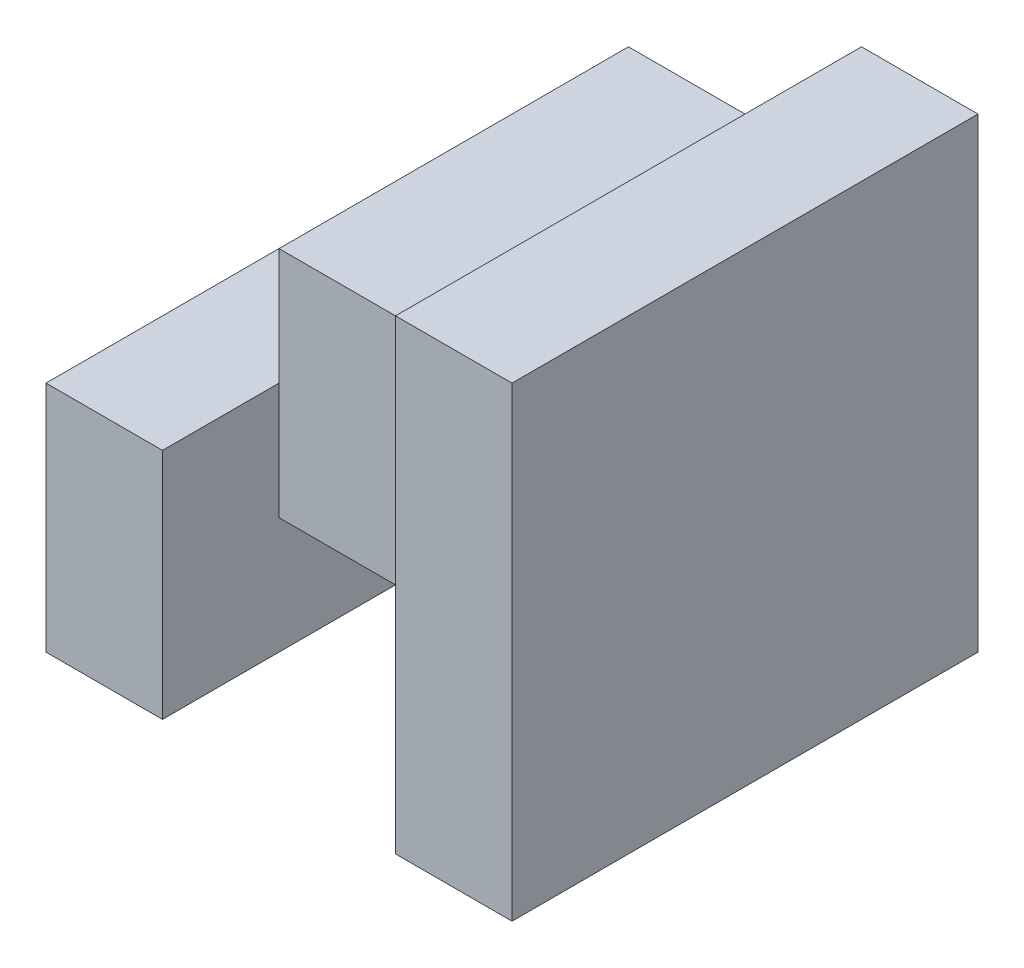
ISO-10303-21;
HEADER;
FILE_DESCRIPTION(('STEP AP214'),'2;1');
FILE_NAME('part.step','',(''),(''),'','','');
FILE_SCHEMA(('AUTOMOTIVE_DESIGN { 1 0 10303 214 1 1 1 1 }'));
ENDSEC;
DATA;
#1=APPLICATION_CONTEXT('core data for automotive mechanical design processes');
#2=APPLICATION_PROTOCOL_DEFINITION('international standard','automotive_design',2000,#1);
#3=PRODUCT_CONTEXT('',#1,'mechanical');
#4=PRODUCT('Part','Part','',(#3));
#5=PRODUCT_RELATED_PRODUCT_CATEGORY('part','',(#4));
#6=PRODUCT_DEFINITION_FORMATION('','',#4);
#7=PRODUCT_DEFINITION_CONTEXT('part definition',#1,'design');
#8=PRODUCT_DEFINITION('design','',#6,#7);
#9=PRODUCT_DEFINITION_SHAPE('','',#8);
#10=(LENGTH_UNIT() NAMED_UNIT(*) SI_UNIT(.MILLI.,.METRE.));
#11=(NAMED_UNIT(*) PLANE_ANGLE_UNIT() SI_UNIT($,.RADIAN.));
#12=(NAMED_UNIT(*) SI_UNIT($,.STERADIAN.) SOLID_ANGLE_UNIT());
#13=UNCERTAINTY_MEASURE_WITH_UNIT(LENGTH_MEASURE(1.E-05),#10,'distance_accuracy_value','');
#14=(GEOMETRIC_REPRESENTATION_CONTEXT(3) GLOBAL_UNCERTAINTY_ASSIGNED_CONTEXT((#13)) GLOBAL_UNIT_ASSIGNED_CONTEXT((#10,
#11,#12)) REPRESENTATION_CONTEXT('',''));
#15=CARTESIAN_POINT('',(0.,0.,0.));
#16=DIRECTION('',(0.,0.,1.));
#17=DIRECTION('',(1.,0.,0.));
#18=AXIS2_PLACEMENT_3D('',#15,#16,#17);
#19=CARTESIAN_POINT('',(3.,1.,4.));
#20=DIRECTION('',(0.,1.,0.));
#21=DIRECTION('',(-1.,0.,0.));
#22=AXIS2_PLACEMENT_3D('',#19,#20,#21);
#23=PLANE('',#22);
#24=DIRECTION('',(1.,0.,0.));
#25=VECTOR('',#24,1.);
#26=CARTESIAN_POINT('',(3.,1.,3.));
#27=LINE('',#26,#25);
#28=CARTESIAN_POINT('',(1.,1.,3.));
#29=VERTEX_POINT('',#28);
#30=CARTESIAN_POINT('',(3.,1.,3.));
#31=VERTEX_POINT('',#30);
#32=EDGE_CURVE('E168',#29,#31,#27,.T.);
#33=ORIENTED_EDGE('',*,*,#32,.F.);
#34=DIRECTION('',(0.,0.,-1.));
#35=VECTOR('',#34,1.);
#36=CARTESIAN_POINT('',(1.,1.,4.));
#37=LINE('',#36,#35);
#38=CARTESIAN_POINT('',(1.,1.,0.));
#39=VERTEX_POINT('',#38);
#40=EDGE_CURVE('E42',#29,#39,#37,.T.);
#41=ORIENTED_EDGE('',*,*,#40,.T.);
#42=DIRECTION('',(1.,0.,0.));
#43=VECTOR('',#42,1.);
#44=CARTESIAN_POINT('',(3.,1.,0.));
#45=LINE('',#44,#43);
#46=CARTESIAN_POINT('',(3.,1.,0.));
#47=VERTEX_POINT('',#46);
#48=EDGE_CURVE('E165',#39,#47,#45,.T.);
#49=ORIENTED_EDGE('',*,*,#48,.T.);
#50=DIRECTION('',(0.,0.,-1.));
#51=VECTOR('',#50,1.);
#52=CARTESIAN_POINT('',(3.,1.,4.));
#53=LINE('',#52,#51);
#54=EDGE_CURVE('E157',#31,#47,#53,.T.);
#55=ORIENTED_EDGE('',*,*,#54,.F.);
#56=EDGE_LOOP('',(#33,#41,#49,#55));
#57=FACE_BOUND('',#56,.T.);
#58=ADVANCED_FACE('F33',(#57),#23,.F.);
#59=CARTESIAN_POINT('',(1.,3.,4.));
#60=DIRECTION('',(0.,-1.,0.));
#61=DIRECTION('',(0.,0.,-1.));
#62=AXIS2_PLACEMENT_3D('',#59,#60,#61);
#63=PLANE('',#62);
#64=DIRECTION('',(-1.,0.,0.));
#65=VECTOR('',#64,1.);
#66=CARTESIAN_POINT('',(1.,3.,3.));
#67=LINE('',#66,#65);
#68=CARTESIAN_POINT('',(3.,3.,3.));
#69=VERTEX_POINT('',#68);
#70=CARTESIAN_POINT('',(1.,3.,3.));
#71=VERTEX_POINT('',#70);
#72=EDGE_CURVE('E224',#69,#71,#67,.T.);
#73=ORIENTED_EDGE('',*,*,#72,.F.);
#74=DIRECTION('',(0.,0.,-1.));
#75=VECTOR('',#74,1.);
#76=CARTESIAN_POINT('',(3.,3.,4.));
#77=LINE('',#76,#75);
#78=CARTESIAN_POINT('',(3.,3.,0.));
#79=VERTEX_POINT('',#78);
#80=EDGE_CURVE('E146',#69,#79,#77,.T.);
#81=ORIENTED_EDGE('',*,*,#80,.T.);
#82=DIRECTION('',(-1.,0.,0.));
#83=VECTOR('',#82,1.);
#84=CARTESIAN_POINT('',(1.,3.,0.));
#85=LINE('',#84,#83);
#86=CARTESIAN_POINT('',(1.,3.,0.));
#87=VERTEX_POINT('',#86);
#88=EDGE_CURVE('E193',#79,#87,#85,.T.);
#89=ORIENTED_EDGE('',*,*,#88,.T.);
#90=DIRECTION('',(0.,0.,-1.));
#91=VECTOR('',#90,1.);
#92=CARTESIAN_POINT('',(1.,3.,4.));
#93=LINE('',#92,#91);
#94=EDGE_CURVE('E150',#71,#87,#93,.T.);
#95=ORIENTED_EDGE('',*,*,#94,.F.);
#96=EDGE_LOOP('',(#73,#81,#89,#95));
#97=FACE_BOUND('',#96,.T.);
#98=ADVANCED_FACE('F221',(#97),#63,.F.);
#99=CARTESIAN_POINT('',(1.,2.,4.));
#100=DIRECTION('',(1.,0.,0.));
#101=DIRECTION('',(0.,0.,-1.));
#102=AXIS2_PLACEMENT_3D('',#99,#100,#101);
#103=PLANE('',#102);
#104=DIRECTION('',(0.,-1.,0.));
#105=VECTOR('',#104,1.);
#106=CARTESIAN_POINT('',(1.,3.,3.));
#107=LINE('',#106,#105);
#108=CARTESIAN_POINT('',(1.,2.,3.));
#109=VERTEX_POINT('',#108);
#110=EDGE_CURVE('E217',#71,#109,#107,.T.);
#111=ORIENTED_EDGE('',*,*,#110,.F.);
#112=ORIENTED_EDGE('',*,*,#94,.T.);
#113=DIRECTION('',(0.,-1.,0.));
#114=VECTOR('',#113,1.);
#115=CARTESIAN_POINT('',(1.,2.,0.));
#116=LINE('',#115,#114);
#117=CARTESIAN_POINT('',(1.,2.,0.));
#118=VERTEX_POINT('',#117);
#119=EDGE_CURVE('E196',#87,#118,#116,.T.);
#120=ORIENTED_EDGE('',*,*,#119,.T.);
#121=DIRECTION('',(0.,0.,-1.));
#122=VECTOR('',#121,1.);
#123=CARTESIAN_POINT('',(1.,2.,4.));
#124=LINE('',#123,#122);
#125=EDGE_CURVE('E206',#109,#118,#124,.T.);
#126=ORIENTED_EDGE('',*,*,#125,.F.);
#127=EDGE_LOOP('',(#111,#112,#120,#126));
#128=FACE_BOUND('',#127,.T.);
#129=ADVANCED_FACE('F212',(#128),#103,.F.);
#130=CARTESIAN_POINT('',(0.,0.,4.));
#131=DIRECTION('',(0.,0.,-1.));
#132=DIRECTION('',(-1.,0.,0.));
#133=AXIS2_PLACEMENT_3D('',#130,#131,#132);
#134=PLANE('',#133);
#135=DIRECTION('',(0.,1.,0.));
#136=VECTOR('',#135,1.);
#137=CARTESIAN_POINT('',(1.,1.,4.));
#138=LINE('',#137,#136);
#139=CARTESIAN_POINT('',(1.,0.,4.));
#140=VERTEX_POINT('',#139);
#141=CARTESIAN_POINT('',(1.,2.,4.));
#142=VERTEX_POINT('',#141);
#143=EDGE_CURVE('E104',#140,#142,#138,.T.);
#144=ORIENTED_EDGE('',*,*,#143,.T.);
#145=DIRECTION('',(-1.,0.,0.));
#146=VECTOR('',#145,1.);
#147=CARTESIAN_POINT('',(0.,2.,4.));
#148=LINE('',#147,#146);
#149=CARTESIAN_POINT('',(0.,2.,4.));
#150=VERTEX_POINT('',#149);
#151=EDGE_CURVE('E140',#142,#150,#148,.T.);
#152=ORIENTED_EDGE('',*,*,#151,.T.);
#153=DIRECTION('',(0.,-1.,0.));
#154=VECTOR('',#153,1.);
#155=CARTESIAN_POINT('',(0.,0.,4.));
#156=LINE('',#155,#154);
#157=CARTESIAN_POINT('',(0.,0.,4.));
#158=VERTEX_POINT('',#157);
#159=EDGE_CURVE('E50',#150,#158,#156,.T.);
#160=ORIENTED_EDGE('',*,*,#159,.T.);
#161=DIRECTION('',(1.,0.,0.));
#162=VECTOR('',#161,1.);
#163=CARTESIAN_POINT('',(1.,0.,4.));
#164=LINE('',#163,#162);
#165=EDGE_CURVE('E201',#158,#140,#164,.T.);
#166=ORIENTED_EDGE('',*,*,#165,.T.);
#167=EDGE_LOOP('',(#144,#152,#160,#166));
#168=FACE_BOUND('',#167,.T.);
#169=ADVANCED_FACE('F274',(#168),#134,.F.);
#170=CARTESIAN_POINT('',(1.,0.,4.));
#171=DIRECTION('',(0.,1.,0.));
#172=DIRECTION('',(-1.,0.,0.));
#173=AXIS2_PLACEMENT_3D('',#170,#171,#172);
#174=PLANE('',#173);
#175=DIRECTION('',(1.,0.,0.));
#176=VECTOR('',#175,1.);
#177=CARTESIAN_POINT('',(1.,0.,0.));
#178=LINE('',#177,#176);
#179=CARTESIAN_POINT('',(0.,0.,0.));
#180=VERTEX_POINT('',#179);
#181=CARTESIAN_POINT('',(1.,0.,0.));
#182=VERTEX_POINT('',#181);
#183=EDGE_CURVE('E177',#180,#182,#178,.T.);
#184=ORIENTED_EDGE('',*,*,#183,.T.);
#185=DIRECTION('',(0.,0.,-1.));
#186=VECTOR('',#185,1.);
#187=CARTESIAN_POINT('',(1.,0.,4.));
#188=LINE('',#187,#186);
#189=EDGE_CURVE('E11',#140,#182,#188,.T.);
#190=ORIENTED_EDGE('',*,*,#189,.F.);
#191=ORIENTED_EDGE('',*,*,#165,.F.);
#192=DIRECTION('',(0.,0.,-1.));
#193=VECTOR('',#192,1.);
#194=CARTESIAN_POINT('',(0.,0.,4.));
#195=LINE('',#194,#193);
#196=EDGE_CURVE('E202',#158,#180,#195,.T.);
#197=ORIENTED_EDGE('',*,*,#196,.T.);
#198=EDGE_LOOP('',(#184,#190,#191,#197));
#199=FACE_BOUND('',#198,.T.);
#200=ADVANCED_FACE('F35',(#199),#174,.F.);
#201=CARTESIAN_POINT('',(1.,1.,4.));
#202=DIRECTION('',(-1.,0.,0.));
#203=DIRECTION('',(0.,0.,1.));
#204=AXIS2_PLACEMENT_3D('',#201,#202,#203);
#205=PLANE('',#204);
#206=ORIENTED_EDGE('',*,*,#189,.T.);
#207=DIRECTION('',(0.,1.,0.));
#208=VECTOR('',#207,1.);
#209=CARTESIAN_POINT('',(1.,1.,0.));
#210=LINE('',#209,#208);
#211=EDGE_CURVE('E171',#182,#39,#210,.T.);
#212=ORIENTED_EDGE('',*,*,#211,.T.);
#213=ORIENTED_EDGE('',*,*,#40,.F.);
#214=EDGE_CURVE('E238',#109,#29,#107,.T.);
#215=ORIENTED_EDGE('',*,*,#214,.F.);
#216=EDGE_CURVE('E207',#142,#109,#124,.T.);
#217=ORIENTED_EDGE('',*,*,#216,.F.);
#218=ORIENTED_EDGE('',*,*,#143,.F.);
#219=EDGE_LOOP('',(#206,#212,#213,#215,#217,#218));
#220=FACE_BOUND('',#219,.T.);
#221=ADVANCED_FACE('F172',(#220),#205,.F.);
#222=CARTESIAN_POINT('',(4.,0.,4.));
#223=DIRECTION('',(0.,1.,0.));
#224=DIRECTION('',(-1.,0.,0.));
#225=AXIS2_PLACEMENT_3D('',#222,#223,#224);
#226=PLANE('',#225);
#227=DIRECTION('',(1.,0.,0.));
#228=VECTOR('',#227,1.);
#229=CARTESIAN_POINT('',(4.,0.,0.));
#230=LINE('',#229,#228);
#231=CARTESIAN_POINT('',(3.,0.,0.));
#232=VERTEX_POINT('',#231);
#233=CARTESIAN_POINT('',(4.,0.,0.));
#234=VERTEX_POINT('',#233);
#235=EDGE_CURVE('E183',#232,#234,#230,.T.);
#236=ORIENTED_EDGE('',*,*,#235,.T.);
#237=DIRECTION('',(0.,0.,-1.));
#238=VECTOR('',#237,1.);
#239=CARTESIAN_POINT('',(4.,0.,4.));
#240=LINE('',#239,#238);
#241=CARTESIAN_POINT('',(4.,0.,4.));
#242=VERTEX_POINT('',#241);
#243=EDGE_CURVE('E148',#242,#234,#240,.T.);
#244=ORIENTED_EDGE('',*,*,#243,.F.);
#245=DIRECTION('',(1.,0.,0.));
#246=VECTOR('',#245,1.);
#247=CARTESIAN_POINT('',(4.,0.,4.));
#248=LINE('',#247,#246);
#249=CARTESIAN_POINT('',(3.,0.,4.));
#250=VERTEX_POINT('',#249);
#251=EDGE_CURVE('E130',#250,#242,#248,.T.);
#252=ORIENTED_EDGE('',*,*,#251,.F.);
#253=DIRECTION('',(0.,0.,-1.));
#254=VECTOR('',#253,1.);
#255=CARTESIAN_POINT('',(3.,0.,4.));
#256=LINE('',#255,#254);
#257=EDGE_CURVE('E127',#250,#232,#256,.T.);
#258=ORIENTED_EDGE('',*,*,#257,.T.);
#259=EDGE_LOOP('',(#236,#244,#252,#258));
#260=FACE_BOUND('',#259,.T.);
#261=ADVANCED_FACE('F257',(#260),#226,.F.);
#262=CARTESIAN_POINT('',(4.,4.,4.));
#263=DIRECTION('',(-1.,0.,0.));
#264=DIRECTION('',(0.,-1.,0.));
#265=AXIS2_PLACEMENT_3D('',#262,#263,#264);
#266=PLANE('',#265);
#267=DIRECTION('',(0.,1.,0.));
#268=VECTOR('',#267,1.);
#269=CARTESIAN_POINT('',(4.,4.,0.));
#270=LINE('',#269,#268);
#271=CARTESIAN_POINT('',(4.,4.,0.));
#272=VERTEX_POINT('',#271);
#273=EDGE_CURVE('E188',#234,#272,#270,.T.);
#274=ORIENTED_EDGE('',*,*,#273,.T.);
#275=DIRECTION('',(0.,0.,-1.));
#276=VECTOR('',#275,1.);
#277=CARTESIAN_POINT('',(4.,4.,4.));
#278=LINE('',#277,#276);
#279=CARTESIAN_POINT('',(4.,4.,4.));
#280=VERTEX_POINT('',#279);
#281=EDGE_CURVE('E145',#280,#272,#278,.T.);
#282=ORIENTED_EDGE('',*,*,#281,.F.);
#283=DIRECTION('',(0.,1.,0.));
#284=VECTOR('',#283,1.);
#285=CARTESIAN_POINT('',(4.,4.,4.));
#286=LINE('',#285,#284);
#287=EDGE_CURVE('E136',#242,#280,#286,.T.);
#288=ORIENTED_EDGE('',*,*,#287,.F.);
#289=ORIENTED_EDGE('',*,*,#243,.T.);
#290=EDGE_LOOP('',(#274,#282,#288,#289));
#291=FACE_BOUND('',#290,.T.);
#292=ADVANCED_FACE('F254',(#291),#266,.F.);
#293=CARTESIAN_POINT('',(3.,4.,4.));
#294=DIRECTION('',(0.,-1.,0.));
#295=DIRECTION('',(0.,0.,-1.));
#296=AXIS2_PLACEMENT_3D('',#293,#294,#295);
#297=PLANE('',#296);
#298=DIRECTION('',(-1.,0.,0.));
#299=VECTOR('',#298,1.);
#300=CARTESIAN_POINT('',(3.,4.,0.));
#301=LINE('',#300,#299);
#302=CARTESIAN_POINT('',(3.,4.,0.));
#303=VERTEX_POINT('',#302);
#304=EDGE_CURVE('E144',#272,#303,#301,.T.);
#305=ORIENTED_EDGE('',*,*,#304,.T.);
#306=DIRECTION('',(0.,0.,-1.));
#307=VECTOR('',#306,1.);
#308=CARTESIAN_POINT('',(3.,4.,4.));
#309=LINE('',#308,#307);
#310=CARTESIAN_POINT('',(3.,4.,4.));
#311=VERTEX_POINT('',#310);
#312=EDGE_CURVE('E124',#311,#303,#309,.T.);
#313=ORIENTED_EDGE('',*,*,#312,.F.);
#314=DIRECTION('',(-1.,0.,0.));
#315=VECTOR('',#314,1.);
#316=CARTESIAN_POINT('',(3.,4.,4.));
#317=LINE('',#316,#315);
#318=EDGE_CURVE('E133',#280,#311,#317,.T.);
#319=ORIENTED_EDGE('',*,*,#318,.F.);
#320=ORIENTED_EDGE('',*,*,#281,.T.);
#321=EDGE_LOOP('',(#305,#313,#319,#320));
#322=FACE_BOUND('',#321,.T.);
#323=ADVANCED_FACE('F142',(#322),#297,.F.);
#324=CARTESIAN_POINT('',(3.,3.,4.));
#325=DIRECTION('',(1.,0.,0.));
#326=DIRECTION('',(0.,0.,-1.));
#327=AXIS2_PLACEMENT_3D('',#324,#325,#326);
#328=PLANE('',#327);
#329=DIRECTION('',(0.,-1.,0.));
#330=VECTOR('',#329,1.);
#331=CARTESIAN_POINT('',(3.,3.,0.));
#332=LINE('',#331,#330);
#333=EDGE_CURVE('E191',#303,#79,#332,.T.);
#334=ORIENTED_EDGE('',*,*,#333,.T.);
#335=ORIENTED_EDGE('',*,*,#80,.F.);
#336=DIRECTION('',(0.,1.,0.));
#337=VECTOR('',#336,1.);
#338=CARTESIAN_POINT('',(3.,3.,3.));
#339=LINE('',#338,#337);
#340=EDGE_CURVE('E235',#31,#69,#339,.T.);
#341=ORIENTED_EDGE('',*,*,#340,.F.);
#342=ORIENTED_EDGE('',*,*,#54,.T.);
#343=DIRECTION('',(0.,-1.,0.));
#344=VECTOR('',#343,1.);
#345=CARTESIAN_POINT('',(3.,0.,0.));
#346=LINE('',#345,#344);
#347=EDGE_CURVE('E181',#47,#232,#346,.T.);
#348=ORIENTED_EDGE('',*,*,#347,.T.);
#349=ORIENTED_EDGE('',*,*,#257,.F.);
#350=DIRECTION('',(0.,-1.,0.));
#351=VECTOR('',#350,1.);
#352=CARTESIAN_POINT('',(3.,0.,4.));
#353=LINE('',#352,#351);
#354=EDGE_CURVE('E119',#311,#250,#353,.T.);
#355=ORIENTED_EDGE('',*,*,#354,.F.);
#356=ORIENTED_EDGE('',*,*,#312,.T.);
#357=EDGE_LOOP('',(#334,#335,#341,#342,#348,#349,#355,#356));
#358=FACE_BOUND('',#357,.T.);
#359=ADVANCED_FACE('F122',(#358),#328,.F.);
#360=CARTESIAN_POINT('',(0.,2.,4.));
#361=DIRECTION('',(0.,-1.,0.));
#362=DIRECTION('',(1.,0.,0.));
#363=AXIS2_PLACEMENT_3D('',#360,#361,#362);
#364=PLANE('',#363);
#365=DIRECTION('',(-1.,0.,0.));
#366=VECTOR('',#365,1.);
#367=CARTESIAN_POINT('',(0.,2.,0.));
#368=LINE('',#367,#366);
#369=CARTESIAN_POINT('',(0.,2.,0.));
#370=VERTEX_POINT('',#369);
#371=EDGE_CURVE('E90',#118,#370,#368,.T.);
#372=ORIENTED_EDGE('',*,*,#371,.T.);
#373=DIRECTION('',(0.,0.,-1.));
#374=VECTOR('',#373,1.);
#375=CARTESIAN_POINT('',(0.,2.,4.));
#376=LINE('',#375,#374);
#377=EDGE_CURVE('E204',#150,#370,#376,.T.);
#378=ORIENTED_EDGE('',*,*,#377,.F.);
#379=ORIENTED_EDGE('',*,*,#151,.F.);
#380=ORIENTED_EDGE('',*,*,#216,.T.);
#381=ORIENTED_EDGE('',*,*,#125,.T.);
#382=EDGE_LOOP('',(#372,#378,#379,#380,#381));
#383=FACE_BOUND('',#382,.T.);
#384=ADVANCED_FACE('F280',(#383),#364,.F.);
#385=CARTESIAN_POINT('',(0.,0.,4.));
#386=DIRECTION('',(1.,0.,0.));
#387=DIRECTION('',(0.,0.,-1.));
#388=AXIS2_PLACEMENT_3D('',#385,#386,#387);
#389=PLANE('',#388);
#390=DIRECTION('',(0.,-1.,0.));
#391=VECTOR('',#390,1.);
#392=CARTESIAN_POINT('',(0.,0.,0.));
#393=LINE('',#392,#391);
#394=EDGE_CURVE('E96',#370,#180,#393,.T.);
#395=ORIENTED_EDGE('',*,*,#394,.T.);
#396=ORIENTED_EDGE('',*,*,#196,.F.);
#397=ORIENTED_EDGE('',*,*,#159,.F.);
#398=ORIENTED_EDGE('',*,*,#377,.T.);
#399=EDGE_LOOP('',(#395,#396,#397,#398));
#400=FACE_BOUND('',#399,.T.);
#401=ADVANCED_FACE('F297',(#400),#389,.F.);
#402=ORIENTED_EDGE('',*,*,#318,.T.);
#403=ORIENTED_EDGE('',*,*,#354,.T.);
#404=ORIENTED_EDGE('',*,*,#251,.T.);
#405=ORIENTED_EDGE('',*,*,#287,.T.);
#406=EDGE_LOOP('',(#402,#403,#404,#405));
#407=FACE_BOUND('',#406,.T.);
#408=ADVANCED_FACE('F134',(#407),#134,.F.);
#409=CARTESIAN_POINT('',(0.,0.,0.));
#410=DIRECTION('',(0.,0.,-1.));
#411=DIRECTION('',(-1.,0.,0.));
#412=AXIS2_PLACEMENT_3D('',#409,#410,#411);
#413=PLANE('',#412);
#414=ORIENTED_EDGE('',*,*,#183,.F.);
#415=ORIENTED_EDGE('',*,*,#394,.F.);
#416=ORIENTED_EDGE('',*,*,#371,.F.);
#417=ORIENTED_EDGE('',*,*,#119,.F.);
#418=ORIENTED_EDGE('',*,*,#88,.F.);
#419=ORIENTED_EDGE('',*,*,#333,.F.);
#420=ORIENTED_EDGE('',*,*,#304,.F.);
#421=ORIENTED_EDGE('',*,*,#273,.F.);
#422=ORIENTED_EDGE('',*,*,#235,.F.);
#423=ORIENTED_EDGE('',*,*,#347,.F.);
#424=ORIENTED_EDGE('',*,*,#48,.F.);
#425=ORIENTED_EDGE('',*,*,#211,.F.);
#426=EDGE_LOOP('',(#414,#415,#416,#417,#418,#419,#420,#421,#422,#423,#424,#425));
#427=FACE_BOUND('',#426,.T.);
#428=ADVANCED_FACE('F179',(#427),#413,.T.);
#429=CARTESIAN_POINT('',(0.,0.,3.));
#430=DIRECTION('',(0.,0.,1.));
#431=DIRECTION('',(1.,0.,0.));
#432=AXIS2_PLACEMENT_3D('',#429,#430,#431);
#433=PLANE('',#432);
#434=ORIENTED_EDGE('',*,*,#32,.T.);
#435=ORIENTED_EDGE('',*,*,#340,.T.);
#436=ORIENTED_EDGE('',*,*,#72,.T.);
#437=ORIENTED_EDGE('',*,*,#110,.T.);
#438=ORIENTED_EDGE('',*,*,#214,.T.);
#439=EDGE_LOOP('',(#434,#435,#436,#437,#438));
#440=FACE_BOUND('',#439,.T.);
#441=ADVANCED_FACE('F242',(#440),#433,.T.);
#442=CLOSED_SHELL('',(#58,#98,#129,#169,#200,#221,#261,#292,#323,#359,#384,#401,#408,#428,#441));
#443=MANIFOLD_SOLID_BREP('B2',#442);
#444=ADVANCED_BREP_SHAPE_REPRESENTATION('',(#18,#443),#14);
#445=SHAPE_DEFINITION_REPRESENTATION(#9,#444);
ENDSEC;
END-ISO-10303-21;
